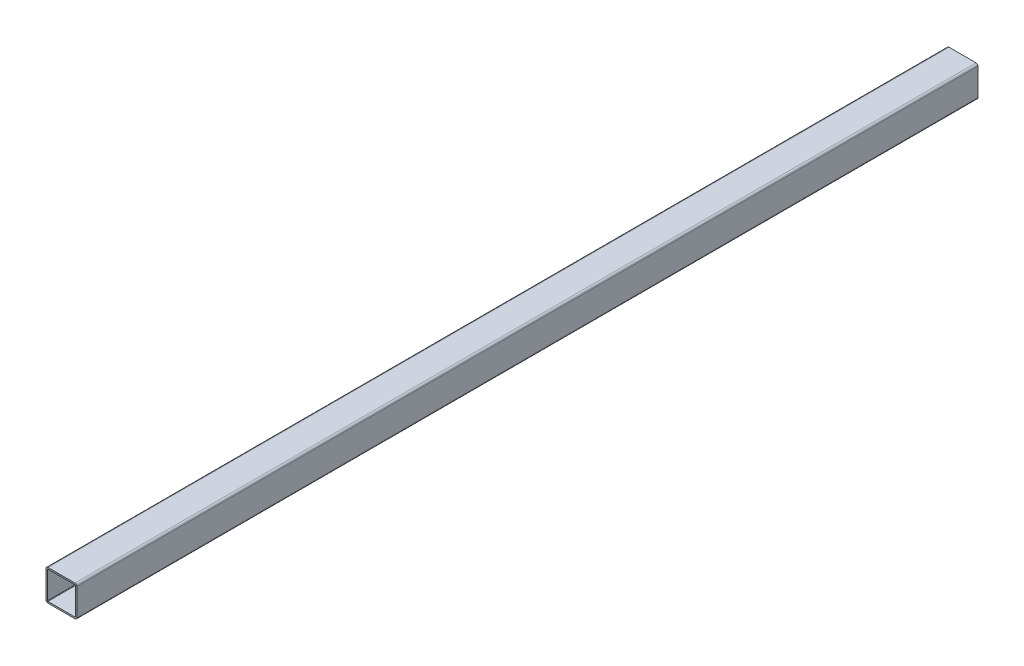
ISO-10303-21;
HEADER;
FILE_DESCRIPTION(('STEP AP214'),'2;1');
FILE_NAME('part.step','',(''),(''),'','','');
FILE_SCHEMA(('AUTOMOTIVE_DESIGN { 1 0 10303 214 1 1 1 1 }'));
ENDSEC;
DATA;
#1=APPLICATION_CONTEXT('core data for automotive mechanical design processes');
#2=APPLICATION_PROTOCOL_DEFINITION('international standard','automotive_design',2000,#1);
#3=PRODUCT_CONTEXT('',#1,'mechanical');
#4=PRODUCT('Part','Part','',(#3));
#5=PRODUCT_RELATED_PRODUCT_CATEGORY('part','',(#4));
#6=PRODUCT_DEFINITION_FORMATION('','',#4);
#7=PRODUCT_DEFINITION_CONTEXT('part definition',#1,'design');
#8=PRODUCT_DEFINITION('design','',#6,#7);
#9=PRODUCT_DEFINITION_SHAPE('','',#8);
#10=(LENGTH_UNIT() NAMED_UNIT(*) SI_UNIT(.MILLI.,.METRE.));
#11=(NAMED_UNIT(*) PLANE_ANGLE_UNIT() SI_UNIT($,.RADIAN.));
#12=(NAMED_UNIT(*) SI_UNIT($,.STERADIAN.) SOLID_ANGLE_UNIT());
#13=UNCERTAINTY_MEASURE_WITH_UNIT(LENGTH_MEASURE(1.E-05),#10,'distance_accuracy_value','');
#14=(GEOMETRIC_REPRESENTATION_CONTEXT(3) GLOBAL_UNCERTAINTY_ASSIGNED_CONTEXT((#13)) GLOBAL_UNIT_ASSIGNED_CONTEXT((#10,
#11,#12)) REPRESENTATION_CONTEXT('',''));
#15=CARTESIAN_POINT('',(0.,0.,0.));
#16=DIRECTION('',(0.,0.,1.));
#17=DIRECTION('',(1.,0.,0.));
#18=AXIS2_PLACEMENT_3D('',#15,#16,#17);
#19=CARTESIAN_POINT('',(14.,-14.,-466.));
#20=DIRECTION('',(0.,0.,1.));
#21=DIRECTION('',(1.,0.,0.));
#22=AXIS2_PLACEMENT_3D('',#19,#20,#21);
#23=CYLINDRICAL_SURFACE('',#22,2.);
#24=DIRECTION('',(0.,0.,1.));
#25=VECTOR('',#24,1.);
#26=CARTESIAN_POINT('',(16.,-14.,-466.));
#27=LINE('',#26,#25);
#28=CARTESIAN_POINT('',(16.,-14.,-466.));
#29=VERTEX_POINT('',#28);
#30=CARTESIAN_POINT('',(16.,-14.,466.));
#31=VERTEX_POINT('',#30);
#32=EDGE_CURVE('E37',#29,#31,#27,.T.);
#33=ORIENTED_EDGE('',*,*,#32,.T.);
#34=CARTESIAN_POINT('',(14.,-14.,466.));
#35=DIRECTION('',(0.,0.,1.));
#36=DIRECTION('',(1.,0.,0.));
#37=AXIS2_PLACEMENT_3D('',#34,#35,#36);
#38=CIRCLE('',#37,2.);
#39=CARTESIAN_POINT('',(14.,-16.,466.));
#40=VERTEX_POINT('',#39);
#41=EDGE_CURVE('E190',#40,#31,#38,.T.);
#42=ORIENTED_EDGE('',*,*,#41,.F.);
#43=DIRECTION('',(0.,0.,1.));
#44=VECTOR('',#43,1.);
#45=CARTESIAN_POINT('',(14.,-16.,-466.));
#46=LINE('',#45,#44);
#47=CARTESIAN_POINT('',(14.,-16.,-466.));
#48=VERTEX_POINT('',#47);
#49=EDGE_CURVE('E11',#48,#40,#46,.T.);
#50=ORIENTED_EDGE('',*,*,#49,.F.);
#51=CARTESIAN_POINT('',(14.,-14.,-466.));
#52=DIRECTION('',(0.,0.,1.));
#53=DIRECTION('',(1.,0.,0.));
#54=AXIS2_PLACEMENT_3D('',#51,#52,#53);
#55=CIRCLE('',#54,2.);
#56=EDGE_CURVE('E233',#48,#29,#55,.T.);
#57=ORIENTED_EDGE('',*,*,#56,.T.);
#58=EDGE_LOOP('',(#33,#42,#50,#57));
#59=FACE_BOUND('',#58,.T.);
#60=ADVANCED_FACE('F34',(#59),#23,.T.);
#61=CARTESIAN_POINT('',(-14.,-16.,-466.));
#62=DIRECTION('',(0.,-1.,0.));
#63=DIRECTION('',(0.,0.,-1.));
#64=AXIS2_PLACEMENT_3D('',#61,#62,#63);
#65=PLANE('',#64);
#66=ORIENTED_EDGE('',*,*,#49,.T.);
#67=DIRECTION('',(1.,0.,0.));
#68=VECTOR('',#67,1.);
#69=CARTESIAN_POINT('',(-14.,-16.,466.));
#70=LINE('',#69,#68);
#71=CARTESIAN_POINT('',(-14.,-16.,466.));
#72=VERTEX_POINT('',#71);
#73=EDGE_CURVE('E211',#72,#40,#70,.T.);
#74=ORIENTED_EDGE('',*,*,#73,.F.);
#75=DIRECTION('',(0.,0.,1.));
#76=VECTOR('',#75,1.);
#77=CARTESIAN_POINT('',(-14.,-16.,-466.));
#78=LINE('',#77,#76);
#79=CARTESIAN_POINT('',(-14.,-16.,-466.));
#80=VERTEX_POINT('',#79);
#81=EDGE_CURVE('E42',#80,#72,#78,.T.);
#82=ORIENTED_EDGE('',*,*,#81,.F.);
#83=DIRECTION('',(1.,0.,0.));
#84=VECTOR('',#83,1.);
#85=CARTESIAN_POINT('',(-14.,-16.,-466.));
#86=LINE('',#85,#84);
#87=EDGE_CURVE('E264',#80,#48,#86,.T.);
#88=ORIENTED_EDGE('',*,*,#87,.T.);
#89=EDGE_LOOP('',(#66,#74,#82,#88));
#90=FACE_BOUND('',#89,.T.);
#91=ADVANCED_FACE('F285',(#90),#65,.T.);
#92=CARTESIAN_POINT('',(-14.,-14.,-466.));
#93=DIRECTION('',(0.,0.,1.));
#94=DIRECTION('',(1.,0.,0.));
#95=AXIS2_PLACEMENT_3D('',#92,#93,#94);
#96=CYLINDRICAL_SURFACE('',#95,2.);
#97=ORIENTED_EDGE('',*,*,#81,.T.);
#98=CARTESIAN_POINT('',(-14.,-14.,466.));
#99=DIRECTION('',(0.,0.,1.));
#100=DIRECTION('',(1.,0.,0.));
#101=AXIS2_PLACEMENT_3D('',#98,#99,#100);
#102=CIRCLE('',#101,2.);
#103=CARTESIAN_POINT('',(-16.,-14.,466.));
#104=VERTEX_POINT('',#103);
#105=EDGE_CURVE('E208',#104,#72,#102,.T.);
#106=ORIENTED_EDGE('',*,*,#105,.F.);
#107=DIRECTION('',(0.,0.,1.));
#108=VECTOR('',#107,1.);
#109=CARTESIAN_POINT('',(-16.,-14.,-466.));
#110=LINE('',#109,#108);
#111=CARTESIAN_POINT('',(-16.,-14.,-466.));
#112=VERTEX_POINT('',#111);
#113=EDGE_CURVE('E268',#112,#104,#110,.T.);
#114=ORIENTED_EDGE('',*,*,#113,.F.);
#115=CARTESIAN_POINT('',(-14.,-14.,-466.));
#116=DIRECTION('',(0.,0.,1.));
#117=DIRECTION('',(1.,0.,0.));
#118=AXIS2_PLACEMENT_3D('',#115,#116,#117);
#119=CIRCLE('',#118,2.);
#120=EDGE_CURVE('E261',#112,#80,#119,.T.);
#121=ORIENTED_EDGE('',*,*,#120,.T.);
#122=EDGE_LOOP('',(#97,#106,#114,#121));
#123=FACE_BOUND('',#122,.T.);
#124=ADVANCED_FACE('F306',(#123),#96,.T.);
#125=CARTESIAN_POINT('',(-16.,-14.,-466.));
#126=DIRECTION('',(-1.,0.,0.));
#127=DIRECTION('',(0.,0.,1.));
#128=AXIS2_PLACEMENT_3D('',#125,#126,#127);
#129=PLANE('',#128);
#130=ORIENTED_EDGE('',*,*,#113,.T.);
#131=DIRECTION('',(0.,-1.,0.));
#132=VECTOR('',#131,1.);
#133=CARTESIAN_POINT('',(-16.,-14.,466.));
#134=LINE('',#133,#132);
#135=CARTESIAN_POINT('',(-16.,14.,466.));
#136=VERTEX_POINT('',#135);
#137=EDGE_CURVE('E205',#136,#104,#134,.T.);
#138=ORIENTED_EDGE('',*,*,#137,.F.);
#139=DIRECTION('',(0.,0.,1.));
#140=VECTOR('',#139,1.);
#141=CARTESIAN_POINT('',(-16.,14.,-466.));
#142=LINE('',#141,#140);
#143=CARTESIAN_POINT('',(-16.,14.,-466.));
#144=VERTEX_POINT('',#143);
#145=EDGE_CURVE('E270',#144,#136,#142,.T.);
#146=ORIENTED_EDGE('',*,*,#145,.F.);
#147=DIRECTION('',(0.,-1.,0.));
#148=VECTOR('',#147,1.);
#149=CARTESIAN_POINT('',(-16.,-14.,-466.));
#150=LINE('',#149,#148);
#151=EDGE_CURVE('E258',#144,#112,#150,.T.);
#152=ORIENTED_EDGE('',*,*,#151,.T.);
#153=EDGE_LOOP('',(#130,#138,#146,#152));
#154=FACE_BOUND('',#153,.T.);
#155=ADVANCED_FACE('F303',(#154),#129,.T.);
#156=CARTESIAN_POINT('',(-14.,14.,-466.));
#157=DIRECTION('',(0.,0.,1.));
#158=DIRECTION('',(1.,0.,0.));
#159=AXIS2_PLACEMENT_3D('',#156,#157,#158);
#160=CYLINDRICAL_SURFACE('',#159,2.);
#161=ORIENTED_EDGE('',*,*,#145,.T.);
#162=CARTESIAN_POINT('',(-14.,14.,466.));
#163=DIRECTION('',(0.,0.,1.));
#164=DIRECTION('',(-1.,0.,0.));
#165=AXIS2_PLACEMENT_3D('',#162,#163,#164);
#166=CIRCLE('',#165,2.);
#167=CARTESIAN_POINT('',(-14.,16.,466.));
#168=VERTEX_POINT('',#167);
#169=EDGE_CURVE('E202',#168,#136,#166,.T.);
#170=ORIENTED_EDGE('',*,*,#169,.F.);
#171=DIRECTION('',(0.,0.,1.));
#172=VECTOR('',#171,1.);
#173=CARTESIAN_POINT('',(-14.,16.,-466.));
#174=LINE('',#173,#172);
#175=CARTESIAN_POINT('',(-14.,16.,-466.));
#176=VERTEX_POINT('',#175);
#177=EDGE_CURVE('E272',#176,#168,#174,.T.);
#178=ORIENTED_EDGE('',*,*,#177,.F.);
#179=CARTESIAN_POINT('',(-14.,14.,-466.));
#180=DIRECTION('',(0.,0.,1.));
#181=DIRECTION('',(-1.,0.,0.));
#182=AXIS2_PLACEMENT_3D('',#179,#180,#181);
#183=CIRCLE('',#182,2.);
#184=EDGE_CURVE('E255',#176,#144,#183,.T.);
#185=ORIENTED_EDGE('',*,*,#184,.T.);
#186=EDGE_LOOP('',(#161,#170,#178,#185));
#187=FACE_BOUND('',#186,.T.);
#188=ADVANCED_FACE('F301',(#187),#160,.T.);
#189=CARTESIAN_POINT('',(-14.,16.,-466.));
#190=DIRECTION('',(0.,1.,0.));
#191=DIRECTION('',(0.,0.,1.));
#192=AXIS2_PLACEMENT_3D('',#189,#190,#191);
#193=PLANE('',#192);
#194=ORIENTED_EDGE('',*,*,#177,.T.);
#195=DIRECTION('',(-1.,0.,0.));
#196=VECTOR('',#195,1.);
#197=CARTESIAN_POINT('',(-14.,16.,466.));
#198=LINE('',#197,#196);
#199=CARTESIAN_POINT('',(14.,16.,466.));
#200=VERTEX_POINT('',#199);
#201=EDGE_CURVE('E199',#200,#168,#198,.T.);
#202=ORIENTED_EDGE('',*,*,#201,.F.);
#203=DIRECTION('',(0.,0.,1.));
#204=VECTOR('',#203,1.);
#205=CARTESIAN_POINT('',(14.,16.,-466.));
#206=LINE('',#205,#204);
#207=CARTESIAN_POINT('',(14.,16.,-466.));
#208=VERTEX_POINT('',#207);
#209=EDGE_CURVE('E274',#208,#200,#206,.T.);
#210=ORIENTED_EDGE('',*,*,#209,.F.);
#211=DIRECTION('',(-1.,0.,0.));
#212=VECTOR('',#211,1.);
#213=CARTESIAN_POINT('',(-14.,16.,-466.));
#214=LINE('',#213,#212);
#215=EDGE_CURVE('E252',#208,#176,#214,.T.);
#216=ORIENTED_EDGE('',*,*,#215,.T.);
#217=EDGE_LOOP('',(#194,#202,#210,#216));
#218=FACE_BOUND('',#217,.T.);
#219=ADVANCED_FACE('F299',(#218),#193,.T.);
#220=CARTESIAN_POINT('',(14.,14.,-466.));
#221=DIRECTION('',(0.,0.,1.));
#222=DIRECTION('',(1.,0.,0.));
#223=AXIS2_PLACEMENT_3D('',#220,#221,#222);
#224=CYLINDRICAL_SURFACE('',#223,2.);
#225=ORIENTED_EDGE('',*,*,#209,.T.);
#226=CARTESIAN_POINT('',(14.,14.,466.));
#227=DIRECTION('',(0.,0.,1.));
#228=DIRECTION('',(1.,0.,0.));
#229=AXIS2_PLACEMENT_3D('',#226,#227,#228);
#230=CIRCLE('',#229,2.);
#231=CARTESIAN_POINT('',(16.,14.,466.));
#232=VERTEX_POINT('',#231);
#233=EDGE_CURVE('E196',#232,#200,#230,.T.);
#234=ORIENTED_EDGE('',*,*,#233,.F.);
#235=DIRECTION('',(0.,0.,1.));
#236=VECTOR('',#235,1.);
#237=CARTESIAN_POINT('',(16.,14.,-466.));
#238=LINE('',#237,#236);
#239=CARTESIAN_POINT('',(16.,14.,-466.));
#240=VERTEX_POINT('',#239);
#241=EDGE_CURVE('E275',#240,#232,#238,.T.);
#242=ORIENTED_EDGE('',*,*,#241,.F.);
#243=CARTESIAN_POINT('',(14.,14.,-466.));
#244=DIRECTION('',(0.,0.,1.));
#245=DIRECTION('',(1.,0.,0.));
#246=AXIS2_PLACEMENT_3D('',#243,#244,#245);
#247=CIRCLE('',#246,2.);
#248=EDGE_CURVE('E249',#240,#208,#247,.T.);
#249=ORIENTED_EDGE('',*,*,#248,.T.);
#250=EDGE_LOOP('',(#225,#234,#242,#249));
#251=FACE_BOUND('',#250,.T.);
#252=ADVANCED_FACE('F295',(#251),#224,.T.);
#253=CARTESIAN_POINT('',(16.,-14.,-466.));
#254=DIRECTION('',(1.,0.,0.));
#255=DIRECTION('',(0.,0.,-1.));
#256=AXIS2_PLACEMENT_3D('',#253,#254,#255);
#257=PLANE('',#256);
#258=ORIENTED_EDGE('',*,*,#241,.T.);
#259=DIRECTION('',(0.,1.,0.));
#260=VECTOR('',#259,1.);
#261=CARTESIAN_POINT('',(16.,-14.,466.));
#262=LINE('',#261,#260);
#263=EDGE_CURVE('E193',#31,#232,#262,.T.);
#264=ORIENTED_EDGE('',*,*,#263,.F.);
#265=ORIENTED_EDGE('',*,*,#32,.F.);
#266=DIRECTION('',(0.,1.,0.));
#267=VECTOR('',#266,1.);
#268=CARTESIAN_POINT('',(16.,-14.,-466.));
#269=LINE('',#268,#267);
#270=EDGE_CURVE('E246',#29,#240,#269,.T.);
#271=ORIENTED_EDGE('',*,*,#270,.T.);
#272=EDGE_LOOP('',(#258,#264,#265,#271));
#273=FACE_BOUND('',#272,.T.);
#274=ADVANCED_FACE('F279',(#273),#257,.T.);
#275=CARTESIAN_POINT('',(14.,-14.,-466.));
#276=DIRECTION('',(0.,0.,1.));
#277=DIRECTION('',(1.,0.,0.));
#278=AXIS2_PLACEMENT_3D('',#275,#276,#277);
#279=PLANE('',#278);
#280=DIRECTION('',(-1.,0.,0.));
#281=VECTOR('',#280,1.);
#282=CARTESIAN_POINT('',(-14.,14.48,-466.));
#283=LINE('',#282,#281);
#284=CARTESIAN_POINT('',(14.,14.48,-466.));
#285=VERTEX_POINT('',#284);
#286=CARTESIAN_POINT('',(-14.,14.48,-466.));
#287=VERTEX_POINT('',#286);
#288=EDGE_CURVE('E159',#285,#287,#283,.T.);
#289=ORIENTED_EDGE('',*,*,#288,.T.);
#290=CARTESIAN_POINT('',(-14.,14.,-466.));
#291=DIRECTION('',(0.,0.,1.));
#292=DIRECTION('',(-1.,0.,0.));
#293=AXIS2_PLACEMENT_3D('',#290,#291,#292);
#294=CIRCLE('',#293,0.48);
#295=CARTESIAN_POINT('',(-14.48,14.,-466.));
#296=VERTEX_POINT('',#295);
#297=EDGE_CURVE('E214',#287,#296,#294,.T.);
#298=ORIENTED_EDGE('',*,*,#297,.T.);
#299=DIRECTION('',(0.,-1.,0.));
#300=VECTOR('',#299,1.);
#301=CARTESIAN_POINT('',(-14.48,-14.,-466.));
#302=LINE('',#301,#300);
#303=CARTESIAN_POINT('',(-14.48,-14.,-466.));
#304=VERTEX_POINT('',#303);
#305=EDGE_CURVE('E154',#296,#304,#302,.T.);
#306=ORIENTED_EDGE('',*,*,#305,.T.);
#307=CARTESIAN_POINT('',(-14.,-14.,-466.));
#308=DIRECTION('',(0.,0.,1.));
#309=DIRECTION('',(1.,0.,0.));
#310=AXIS2_PLACEMENT_3D('',#307,#308,#309);
#311=CIRCLE('',#310,0.48);
#312=CARTESIAN_POINT('',(-14.,-14.48,-466.));
#313=VERTEX_POINT('',#312);
#314=EDGE_CURVE('E50',#304,#313,#311,.T.);
#315=ORIENTED_EDGE('',*,*,#314,.T.);
#316=DIRECTION('',(1.,0.,0.));
#317=VECTOR('',#316,1.);
#318=CARTESIAN_POINT('',(-14.,-14.48,-466.));
#319=LINE('',#318,#317);
#320=CARTESIAN_POINT('',(14.,-14.48,-466.));
#321=VERTEX_POINT('',#320);
#322=EDGE_CURVE('E218',#313,#321,#319,.T.);
#323=ORIENTED_EDGE('',*,*,#322,.T.);
#324=CARTESIAN_POINT('',(14.,-14.,-466.));
#325=DIRECTION('',(0.,0.,1.));
#326=DIRECTION('',(1.,0.,0.));
#327=AXIS2_PLACEMENT_3D('',#324,#325,#326);
#328=CIRCLE('',#327,0.48);
#329=CARTESIAN_POINT('',(14.48,-14.,-466.));
#330=VERTEX_POINT('',#329);
#331=EDGE_CURVE('E221',#321,#330,#328,.T.);
#332=ORIENTED_EDGE('',*,*,#331,.T.);
#333=DIRECTION('',(0.,1.,0.));
#334=VECTOR('',#333,1.);
#335=CARTESIAN_POINT('',(14.48,-14.,-466.));
#336=LINE('',#335,#334);
#337=CARTESIAN_POINT('',(14.48,14.,-466.));
#338=VERTEX_POINT('',#337);
#339=EDGE_CURVE('E224',#330,#338,#336,.T.);
#340=ORIENTED_EDGE('',*,*,#339,.T.);
#341=CARTESIAN_POINT('',(14.,14.,-466.));
#342=DIRECTION('',(0.,0.,1.));
#343=DIRECTION('',(1.,0.,0.));
#344=AXIS2_PLACEMENT_3D('',#341,#342,#343);
#345=CIRCLE('',#344,0.48);
#346=EDGE_CURVE('E227',#338,#285,#345,.T.);
#347=ORIENTED_EDGE('',*,*,#346,.T.);
#348=EDGE_LOOP('',(#289,#298,#306,#315,#323,#332,#340,#347));
#349=FACE_BOUND('',#348,.T.);
#350=ORIENTED_EDGE('',*,*,#56,.F.);
#351=ORIENTED_EDGE('',*,*,#87,.F.);
#352=ORIENTED_EDGE('',*,*,#120,.F.);
#353=ORIENTED_EDGE('',*,*,#151,.F.);
#354=ORIENTED_EDGE('',*,*,#184,.F.);
#355=ORIENTED_EDGE('',*,*,#215,.F.);
#356=ORIENTED_EDGE('',*,*,#248,.F.);
#357=ORIENTED_EDGE('',*,*,#270,.F.);
#358=EDGE_LOOP('',(#350,#351,#352,#353,#354,#355,#356,#357));
#359=FACE_BOUND('',#358,.T.);
#360=ADVANCED_FACE('F289',(#349,#359),#279,.F.);
#361=CARTESIAN_POINT('',(-14.,14.,-466.));
#362=DIRECTION('',(0.,0.,1.));
#363=DIRECTION('',(1.,0.,0.));
#364=AXIS2_PLACEMENT_3D('',#361,#362,#363);
#365=CYLINDRICAL_SURFACE('',#364,0.48);
#366=DIRECTION('',(0.,0.,1.));
#367=VECTOR('',#366,1.);
#368=CARTESIAN_POINT('',(-14.,14.48,-466.));
#369=LINE('',#368,#367);
#370=CARTESIAN_POINT('',(-14.,14.48,466.));
#371=VERTEX_POINT('',#370);
#372=EDGE_CURVE('E164',#287,#371,#369,.T.);
#373=ORIENTED_EDGE('',*,*,#372,.T.);
#374=CARTESIAN_POINT('',(-14.,14.,466.));
#375=DIRECTION('',(0.,0.,1.));
#376=DIRECTION('',(-1.,0.,0.));
#377=AXIS2_PLACEMENT_3D('',#374,#375,#376);
#378=CIRCLE('',#377,0.48);
#379=CARTESIAN_POINT('',(-14.48,14.,466.));
#380=VERTEX_POINT('',#379);
#381=EDGE_CURVE('E162',#371,#380,#378,.T.);
#382=ORIENTED_EDGE('',*,*,#381,.T.);
#383=DIRECTION('',(0.,0.,1.));
#384=VECTOR('',#383,1.);
#385=CARTESIAN_POINT('',(-14.48,14.,-466.));
#386=LINE('',#385,#384);
#387=EDGE_CURVE('E147',#296,#380,#386,.T.);
#388=ORIENTED_EDGE('',*,*,#387,.F.);
#389=ORIENTED_EDGE('',*,*,#297,.F.);
#390=EDGE_LOOP('',(#373,#382,#388,#389));
#391=FACE_BOUND('',#390,.T.);
#392=ADVANCED_FACE('F163',(#391),#365,.F.);
#393=CARTESIAN_POINT('',(-14.,14.48,-466.));
#394=DIRECTION('',(0.,1.,0.));
#395=DIRECTION('',(0.,0.,1.));
#396=AXIS2_PLACEMENT_3D('',#393,#394,#395);
#397=PLANE('',#396);
#398=DIRECTION('',(0.,0.,1.));
#399=VECTOR('',#398,1.);
#400=CARTESIAN_POINT('',(14.,14.48,-466.));
#401=LINE('',#400,#399);
#402=CARTESIAN_POINT('',(14.,14.48,466.));
#403=VERTEX_POINT('',#402);
#404=EDGE_CURVE('E234',#285,#403,#401,.T.);
#405=ORIENTED_EDGE('',*,*,#404,.T.);
#406=DIRECTION('',(-1.,0.,0.));
#407=VECTOR('',#406,1.);
#408=CARTESIAN_POINT('',(-14.,14.48,466.));
#409=LINE('',#408,#407);
#410=EDGE_CURVE('E188',#403,#371,#409,.T.);
#411=ORIENTED_EDGE('',*,*,#410,.T.);
#412=ORIENTED_EDGE('',*,*,#372,.F.);
#413=ORIENTED_EDGE('',*,*,#288,.F.);
#414=EDGE_LOOP('',(#405,#411,#412,#413));
#415=FACE_BOUND('',#414,.T.);
#416=ADVANCED_FACE('F381',(#415),#397,.F.);
#417=CARTESIAN_POINT('',(14.,14.,-466.));
#418=DIRECTION('',(0.,0.,1.));
#419=DIRECTION('',(1.,0.,0.));
#420=AXIS2_PLACEMENT_3D('',#417,#418,#419);
#421=CYLINDRICAL_SURFACE('',#420,0.48);
#422=DIRECTION('',(0.,0.,1.));
#423=VECTOR('',#422,1.);
#424=CARTESIAN_POINT('',(14.48,14.,-466.));
#425=LINE('',#424,#423);
#426=CARTESIAN_POINT('',(14.48,14.,466.));
#427=VERTEX_POINT('',#426);
#428=EDGE_CURVE('E236',#338,#427,#425,.T.);
#429=ORIENTED_EDGE('',*,*,#428,.T.);
#430=CARTESIAN_POINT('',(14.,14.,466.));
#431=DIRECTION('',(0.,0.,1.));
#432=DIRECTION('',(1.,0.,0.));
#433=AXIS2_PLACEMENT_3D('',#430,#431,#432);
#434=CIRCLE('',#433,0.48);
#435=EDGE_CURVE('E185',#427,#403,#434,.T.);
#436=ORIENTED_EDGE('',*,*,#435,.T.);
#437=ORIENTED_EDGE('',*,*,#404,.F.);
#438=ORIENTED_EDGE('',*,*,#346,.F.);
#439=EDGE_LOOP('',(#429,#436,#437,#438));
#440=FACE_BOUND('',#439,.T.);
#441=ADVANCED_FACE('F390',(#440),#421,.F.);
#442=CARTESIAN_POINT('',(14.48,-14.,-466.));
#443=DIRECTION('',(1.,0.,0.));
#444=DIRECTION('',(0.,0.,-1.));
#445=AXIS2_PLACEMENT_3D('',#442,#443,#444);
#446=PLANE('',#445);
#447=DIRECTION('',(0.,0.,1.));
#448=VECTOR('',#447,1.);
#449=CARTESIAN_POINT('',(14.48,-14.,-466.));
#450=LINE('',#449,#448);
#451=CARTESIAN_POINT('',(14.48,-14.,466.));
#452=VERTEX_POINT('',#451);
#453=EDGE_CURVE('E238',#330,#452,#450,.T.);
#454=ORIENTED_EDGE('',*,*,#453,.T.);
#455=DIRECTION('',(0.,1.,0.));
#456=VECTOR('',#455,1.);
#457=CARTESIAN_POINT('',(14.48,-14.,466.));
#458=LINE('',#457,#456);
#459=EDGE_CURVE('E182',#452,#427,#458,.T.);
#460=ORIENTED_EDGE('',*,*,#459,.T.);
#461=ORIENTED_EDGE('',*,*,#428,.F.);
#462=ORIENTED_EDGE('',*,*,#339,.F.);
#463=EDGE_LOOP('',(#454,#460,#461,#462));
#464=FACE_BOUND('',#463,.T.);
#465=ADVANCED_FACE('F400',(#464),#446,.F.);
#466=CARTESIAN_POINT('',(14.,-14.,-466.));
#467=DIRECTION('',(0.,0.,1.));
#468=DIRECTION('',(1.,0.,0.));
#469=AXIS2_PLACEMENT_3D('',#466,#467,#468);
#470=CYLINDRICAL_SURFACE('',#469,0.48);
#471=DIRECTION('',(0.,0.,1.));
#472=VECTOR('',#471,1.);
#473=CARTESIAN_POINT('',(14.,-14.48,-466.));
#474=LINE('',#473,#472);
#475=CARTESIAN_POINT('',(14.,-14.48,466.));
#476=VERTEX_POINT('',#475);
#477=EDGE_CURVE('E240',#321,#476,#474,.T.);
#478=ORIENTED_EDGE('',*,*,#477,.T.);
#479=CARTESIAN_POINT('',(14.,-14.,466.));
#480=DIRECTION('',(0.,0.,1.));
#481=DIRECTION('',(1.,0.,0.));
#482=AXIS2_PLACEMENT_3D('',#479,#480,#481);
#483=CIRCLE('',#482,0.48);
#484=EDGE_CURVE('E179',#476,#452,#483,.T.);
#485=ORIENTED_EDGE('',*,*,#484,.T.);
#486=ORIENTED_EDGE('',*,*,#453,.F.);
#487=ORIENTED_EDGE('',*,*,#331,.F.);
#488=EDGE_LOOP('',(#478,#485,#486,#487));
#489=FACE_BOUND('',#488,.T.);
#490=ADVANCED_FACE('F410',(#489),#470,.F.);
#491=CARTESIAN_POINT('',(-14.,-14.48,-466.));
#492=DIRECTION('',(0.,-1.,0.));
#493=DIRECTION('',(0.,0.,-1.));
#494=AXIS2_PLACEMENT_3D('',#491,#492,#493);
#495=PLANE('',#494);
#496=DIRECTION('',(0.,0.,1.));
#497=VECTOR('',#496,1.);
#498=CARTESIAN_POINT('',(-14.,-14.48,-466.));
#499=LINE('',#498,#497);
#500=CARTESIAN_POINT('',(-14.,-14.48,466.));
#501=VERTEX_POINT('',#500);
#502=EDGE_CURVE('E242',#313,#501,#499,.T.);
#503=ORIENTED_EDGE('',*,*,#502,.T.);
#504=DIRECTION('',(1.,0.,0.));
#505=VECTOR('',#504,1.);
#506=CARTESIAN_POINT('',(-14.,-14.48,466.));
#507=LINE('',#506,#505);
#508=EDGE_CURVE('E174',#501,#476,#507,.T.);
#509=ORIENTED_EDGE('',*,*,#508,.T.);
#510=ORIENTED_EDGE('',*,*,#477,.F.);
#511=ORIENTED_EDGE('',*,*,#322,.F.);
#512=EDGE_LOOP('',(#503,#509,#510,#511));
#513=FACE_BOUND('',#512,.T.);
#514=ADVANCED_FACE('F420',(#513),#495,.F.);
#515=CARTESIAN_POINT('',(-14.,-14.,-466.));
#516=DIRECTION('',(0.,0.,1.));
#517=DIRECTION('',(1.,0.,0.));
#518=AXIS2_PLACEMENT_3D('',#515,#516,#517);
#519=CYLINDRICAL_SURFACE('',#518,0.48);
#520=DIRECTION('',(0.,0.,1.));
#521=VECTOR('',#520,1.);
#522=CARTESIAN_POINT('',(-14.48,-14.,-466.));
#523=LINE('',#522,#521);
#524=CARTESIAN_POINT('',(-14.48,-14.,466.));
#525=VERTEX_POINT('',#524);
#526=EDGE_CURVE('E158',#304,#525,#523,.T.);
#527=ORIENTED_EDGE('',*,*,#526,.T.);
#528=CARTESIAN_POINT('',(-14.,-14.,466.));
#529=DIRECTION('',(0.,0.,1.));
#530=DIRECTION('',(1.,0.,0.));
#531=AXIS2_PLACEMENT_3D('',#528,#529,#530);
#532=CIRCLE('',#531,0.48);
#533=EDGE_CURVE('E172',#525,#501,#532,.T.);
#534=ORIENTED_EDGE('',*,*,#533,.T.);
#535=ORIENTED_EDGE('',*,*,#502,.F.);
#536=ORIENTED_EDGE('',*,*,#314,.F.);
#537=EDGE_LOOP('',(#527,#534,#535,#536));
#538=FACE_BOUND('',#537,.T.);
#539=ADVANCED_FACE('F430',(#538),#519,.F.);
#540=CARTESIAN_POINT('',(-14.48,-14.,-466.));
#541=DIRECTION('',(-1.,0.,0.));
#542=DIRECTION('',(0.,0.,1.));
#543=AXIS2_PLACEMENT_3D('',#540,#541,#542);
#544=PLANE('',#543);
#545=ORIENTED_EDGE('',*,*,#387,.T.);
#546=DIRECTION('',(0.,-1.,0.));
#547=VECTOR('',#546,1.);
#548=CARTESIAN_POINT('',(-14.48,-14.,466.));
#549=LINE('',#548,#547);
#550=EDGE_CURVE('E151',#380,#525,#549,.T.);
#551=ORIENTED_EDGE('',*,*,#550,.T.);
#552=ORIENTED_EDGE('',*,*,#526,.F.);
#553=ORIENTED_EDGE('',*,*,#305,.F.);
#554=EDGE_LOOP('',(#545,#551,#552,#553));
#555=FACE_BOUND('',#554,.T.);
#556=ADVANCED_FACE('F149',(#555),#544,.F.);
#557=CARTESIAN_POINT('',(14.,-14.,466.));
#558=DIRECTION('',(0.,0.,1.));
#559=DIRECTION('',(1.,0.,0.));
#560=AXIS2_PLACEMENT_3D('',#557,#558,#559);
#561=PLANE('',#560);
#562=ORIENTED_EDGE('',*,*,#41,.T.);
#563=ORIENTED_EDGE('',*,*,#263,.T.);
#564=ORIENTED_EDGE('',*,*,#233,.T.);
#565=ORIENTED_EDGE('',*,*,#201,.T.);
#566=ORIENTED_EDGE('',*,*,#169,.T.);
#567=ORIENTED_EDGE('',*,*,#137,.T.);
#568=ORIENTED_EDGE('',*,*,#105,.T.);
#569=ORIENTED_EDGE('',*,*,#73,.T.);
#570=EDGE_LOOP('',(#562,#563,#564,#565,#566,#567,#568,#569));
#571=FACE_BOUND('',#570,.T.);
#572=ORIENTED_EDGE('',*,*,#550,.F.);
#573=ORIENTED_EDGE('',*,*,#381,.F.);
#574=ORIENTED_EDGE('',*,*,#410,.F.);
#575=ORIENTED_EDGE('',*,*,#435,.F.);
#576=ORIENTED_EDGE('',*,*,#459,.F.);
#577=ORIENTED_EDGE('',*,*,#484,.F.);
#578=ORIENTED_EDGE('',*,*,#508,.F.);
#579=ORIENTED_EDGE('',*,*,#533,.F.);
#580=EDGE_LOOP('',(#572,#573,#574,#575,#576,#577,#578,#579));
#581=FACE_BOUND('',#580,.T.);
#582=ADVANCED_FACE('F169',(#571,#581),#561,.T.);
#583=CLOSED_SHELL('',(#60,#91,#124,#155,#188,#219,#252,#274,#360,#392,#416,#441,#465,#490,#514,
#539,#556,#582));
#584=MANIFOLD_SOLID_BREP('B2',#583);
#585=ADVANCED_BREP_SHAPE_REPRESENTATION('',(#18,#584),#14);
#586=SHAPE_DEFINITION_REPRESENTATION(#9,#585);
ENDSEC;
END-ISO-10303-21;
